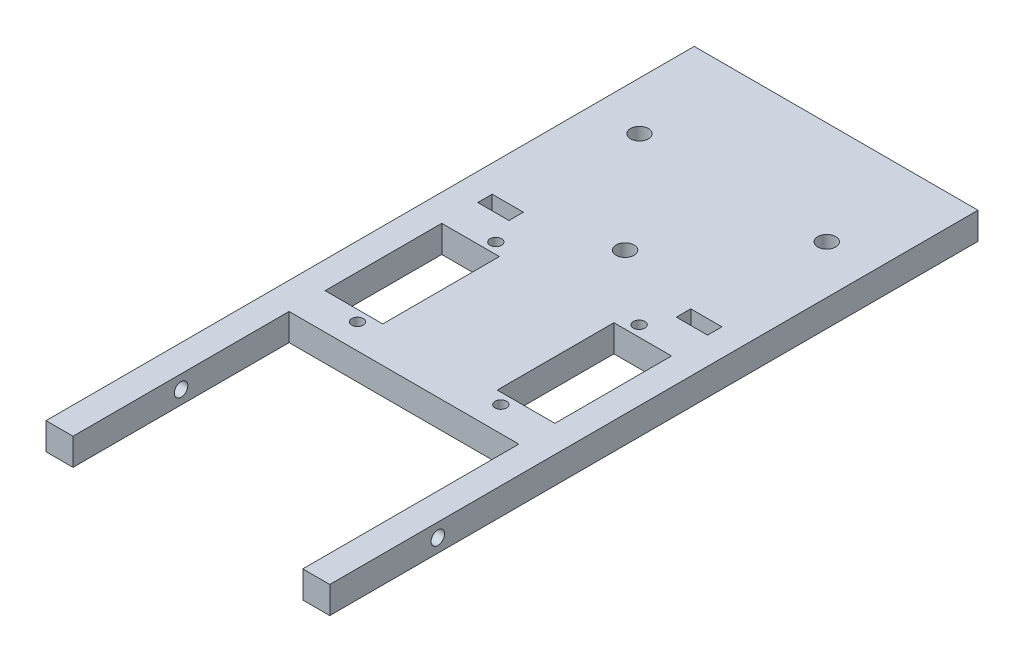
ISO-10303-21;
HEADER;
FILE_DESCRIPTION(('STEP AP214'),'2;1');
FILE_NAME('part.step','',(''),(''),'','','');
FILE_SCHEMA(('AUTOMOTIVE_DESIGN { 1 0 10303 214 1 1 1 1 }'));
ENDSEC;
DATA;
#1=APPLICATION_CONTEXT('core data for automotive mechanical design processes');
#2=APPLICATION_PROTOCOL_DEFINITION('international standard','automotive_design',2000,#1);
#3=PRODUCT_CONTEXT('',#1,'mechanical');
#4=PRODUCT('Part','Part','',(#3));
#5=PRODUCT_RELATED_PRODUCT_CATEGORY('part','',(#4));
#6=PRODUCT_DEFINITION_FORMATION('','',#4);
#7=PRODUCT_DEFINITION_CONTEXT('part definition',#1,'design');
#8=PRODUCT_DEFINITION('design','',#6,#7);
#9=PRODUCT_DEFINITION_SHAPE('','',#8);
#10=(LENGTH_UNIT() NAMED_UNIT(*) SI_UNIT(.MILLI.,.METRE.));
#11=(NAMED_UNIT(*) PLANE_ANGLE_UNIT() SI_UNIT($,.RADIAN.));
#12=(NAMED_UNIT(*) SI_UNIT($,.STERADIAN.) SOLID_ANGLE_UNIT());
#13=UNCERTAINTY_MEASURE_WITH_UNIT(LENGTH_MEASURE(1.E-05),#10,'distance_accuracy_value','');
#14=(GEOMETRIC_REPRESENTATION_CONTEXT(3) GLOBAL_UNCERTAINTY_ASSIGNED_CONTEXT((#13)) GLOBAL_UNIT_ASSIGNED_CONTEXT((#10,
#11,#12)) REPRESENTATION_CONTEXT('',''));
#15=CARTESIAN_POINT('',(0.,0.,0.));
#16=DIRECTION('',(0.,0.,1.));
#17=DIRECTION('',(1.,0.,0.));
#18=AXIS2_PLACEMENT_3D('',#15,#16,#17);
#19=CARTESIAN_POINT('',(-50.038,9.525,114.3));
#20=DIRECTION('',(0.,0.,-1.));
#21=DIRECTION('',(-1.,0.,0.));
#22=AXIS2_PLACEMENT_3D('',#19,#20,#21);
#23=PLANE('',#22);
#24=DIRECTION('',(1.,0.,0.));
#25=VECTOR('',#24,1.);
#26=CARTESIAN_POINT('',(-50.038,0.,114.3));
#27=LINE('',#26,#25);
#28=CARTESIAN_POINT('',(-50.038,0.,114.3));
#29=VERTEX_POINT('',#28);
#30=CARTESIAN_POINT('',(-40.513,0.,114.3));
#31=VERTEX_POINT('',#30);
#32=EDGE_CURVE('E362',#29,#31,#27,.T.);
#33=ORIENTED_EDGE('',*,*,#32,.T.);
#34=DIRECTION('',(0.,1.,0.));
#35=VECTOR('',#34,1.);
#36=CARTESIAN_POINT('',(-40.513,0.,114.3));
#37=LINE('',#36,#35);
#38=CARTESIAN_POINT('',(-40.513,9.525,114.3));
#39=VERTEX_POINT('',#38);
#40=EDGE_CURVE('E342',#31,#39,#37,.T.);
#41=ORIENTED_EDGE('',*,*,#40,.T.);
#42=DIRECTION('',(1.,0.,0.));
#43=VECTOR('',#42,1.);
#44=CARTESIAN_POINT('',(-50.038,9.525,114.3));
#45=LINE('',#44,#43);
#46=CARTESIAN_POINT('',(-50.038,9.525,114.3));
#47=VERTEX_POINT('',#46);
#48=EDGE_CURVE('E367',#47,#39,#45,.T.);
#49=ORIENTED_EDGE('',*,*,#48,.F.);
#50=DIRECTION('',(0.,-1.,0.));
#51=VECTOR('',#50,1.);
#52=CARTESIAN_POINT('',(-50.038,9.525,114.3));
#53=LINE('',#52,#51);
#54=EDGE_CURVE('E382',#47,#29,#53,.T.);
#55=ORIENTED_EDGE('',*,*,#54,.T.);
#56=EDGE_LOOP('',(#33,#41,#49,#55));
#57=FACE_BOUND('',#56,.T.);
#58=ADVANCED_FACE('F33',(#57),#23,.F.);
#59=CARTESIAN_POINT('',(50.038,9.525,-114.3));
#60=DIRECTION('',(-1.,0.,0.));
#61=DIRECTION('',(0.,0.,1.));
#62=AXIS2_PLACEMENT_3D('',#59,#60,#61);
#63=PLANE('',#62);
#64=CARTESIAN_POINT('',(50.038,4.7625,76.2));
#65=DIRECTION('',(1.,0.,0.));
#66=DIRECTION('',(0.,0.,-1.));
#67=AXIS2_PLACEMENT_3D('',#64,#65,#66);
#68=CIRCLE('',#67,2.38125000000001);
#69=CARTESIAN_POINT('',(50.038,4.7625,73.81875));
#70=VERTEX_POINT('',#69);
#71=EDGE_CURVE('E455',#70,#70,#68,.T.);
#72=ORIENTED_EDGE('',*,*,#71,.F.);
#73=EDGE_LOOP('',(#72));
#74=FACE_BOUND('',#73,.T.);
#75=DIRECTION('',(0.,0.,-1.));
#76=VECTOR('',#75,1.);
#77=CARTESIAN_POINT('',(50.038,0.,-114.3));
#78=LINE('',#77,#76);
#79=CARTESIAN_POINT('',(50.038,0.,114.3));
#80=VERTEX_POINT('',#79);
#81=CARTESIAN_POINT('',(50.038,0.,-114.3));
#82=VERTEX_POINT('',#81);
#83=EDGE_CURVE('E351',#80,#82,#78,.T.);
#84=ORIENTED_EDGE('',*,*,#83,.T.);
#85=DIRECTION('',(0.,-1.,0.));
#86=VECTOR('',#85,1.);
#87=CARTESIAN_POINT('',(50.038,9.525,-114.3));
#88=LINE('',#87,#86);
#89=CARTESIAN_POINT('',(50.038,9.525,-114.3));
#90=VERTEX_POINT('',#89);
#91=EDGE_CURVE('E11',#90,#82,#88,.T.);
#92=ORIENTED_EDGE('',*,*,#91,.F.);
#93=DIRECTION('',(0.,0.,-1.));
#94=VECTOR('',#93,1.);
#95=CARTESIAN_POINT('',(50.038,9.525,-114.3));
#96=LINE('',#95,#94);
#97=CARTESIAN_POINT('',(50.038,9.525,114.3));
#98=VERTEX_POINT('',#97);
#99=EDGE_CURVE('E358',#98,#90,#96,.T.);
#100=ORIENTED_EDGE('',*,*,#99,.F.);
#101=DIRECTION('',(0.,-1.,0.));
#102=VECTOR('',#101,1.);
#103=CARTESIAN_POINT('',(50.038,9.525,114.3));
#104=LINE('',#103,#102);
#105=EDGE_CURVE('E370',#98,#80,#104,.T.);
#106=ORIENTED_EDGE('',*,*,#105,.T.);
#107=EDGE_LOOP('',(#84,#92,#100,#106));
#108=FACE_BOUND('',#107,.T.);
#109=ADVANCED_FACE('F35',(#74,#108),#63,.F.);
#110=CARTESIAN_POINT('',(-50.038,9.525,-114.3));
#111=DIRECTION('',(0.,0.,1.));
#112=DIRECTION('',(1.,0.,0.));
#113=AXIS2_PLACEMENT_3D('',#110,#111,#112);
#114=PLANE('',#113);
#115=DIRECTION('',(-1.,0.,0.));
#116=VECTOR('',#115,1.);
#117=CARTESIAN_POINT('',(-50.038,0.,-114.3));
#118=LINE('',#117,#116);
#119=CARTESIAN_POINT('',(-50.038,0.,-114.3));
#120=VERTEX_POINT('',#119);
#121=EDGE_CURVE('E373',#82,#120,#118,.T.);
#122=ORIENTED_EDGE('',*,*,#121,.T.);
#123=DIRECTION('',(0.,-1.,0.));
#124=VECTOR('',#123,1.);
#125=CARTESIAN_POINT('',(-50.038,9.525,-114.3));
#126=LINE('',#125,#124);
#127=CARTESIAN_POINT('',(-50.038,9.525,-114.3));
#128=VERTEX_POINT('',#127);
#129=EDGE_CURVE('E42',#128,#120,#126,.T.);
#130=ORIENTED_EDGE('',*,*,#129,.F.);
#131=DIRECTION('',(-1.,0.,0.));
#132=VECTOR('',#131,1.);
#133=CARTESIAN_POINT('',(-50.038,9.525,-114.3));
#134=LINE('',#133,#132);
#135=EDGE_CURVE('E361',#90,#128,#134,.T.);
#136=ORIENTED_EDGE('',*,*,#135,.F.);
#137=ORIENTED_EDGE('',*,*,#91,.T.);
#138=EDGE_LOOP('',(#122,#130,#136,#137));
#139=FACE_BOUND('',#138,.T.);
#140=ADVANCED_FACE('F405',(#139),#114,.F.);
#141=CARTESIAN_POINT('',(-50.038,9.525,-114.3));
#142=DIRECTION('',(1.,0.,0.));
#143=DIRECTION('',(0.,0.,-1.));
#144=AXIS2_PLACEMENT_3D('',#141,#142,#143);
#145=PLANE('',#144);
#146=CARTESIAN_POINT('',(-50.038,4.7625,76.2));
#147=DIRECTION('',(1.,0.,0.));
#148=DIRECTION('',(0.,0.,-1.));
#149=AXIS2_PLACEMENT_3D('',#146,#147,#148);
#150=CIRCLE('',#149,2.38125000000001);
#151=CARTESIAN_POINT('',(-50.038,4.7625,73.81875));
#152=VERTEX_POINT('',#151);
#153=EDGE_CURVE('E453',#152,#152,#150,.T.);
#154=ORIENTED_EDGE('',*,*,#153,.T.);
#155=EDGE_LOOP('',(#154));
#156=FACE_BOUND('',#155,.T.);
#157=DIRECTION('',(0.,0.,1.));
#158=VECTOR('',#157,1.);
#159=CARTESIAN_POINT('',(-50.038,0.,-114.3));
#160=LINE('',#159,#158);
#161=EDGE_CURVE('E375',#120,#29,#160,.T.);
#162=ORIENTED_EDGE('',*,*,#161,.T.);
#163=ORIENTED_EDGE('',*,*,#54,.F.);
#164=DIRECTION('',(0.,0.,1.));
#165=VECTOR('',#164,1.);
#166=CARTESIAN_POINT('',(-50.038,9.525,-114.3));
#167=LINE('',#166,#165);
#168=EDGE_CURVE('E364',#128,#47,#167,.T.);
#169=ORIENTED_EDGE('',*,*,#168,.F.);
#170=ORIENTED_EDGE('',*,*,#129,.T.);
#171=EDGE_LOOP('',(#162,#163,#169,#170));
#172=FACE_BOUND('',#171,.T.);
#173=ADVANCED_FACE('F390',(#156,#172),#145,.F.);
#174=CARTESIAN_POINT('',(40.513,9.525,114.3));
#175=VERTEX_POINT('',#174);
#176=EDGE_CURVE('E366',#175,#98,#45,.T.);
#177=ORIENTED_EDGE('',*,*,#176,.F.);
#178=DIRECTION('',(0.,1.,0.));
#179=VECTOR('',#178,1.);
#180=CARTESIAN_POINT('',(40.513,0.,114.3));
#181=LINE('',#180,#179);
#182=CARTESIAN_POINT('',(40.513,0.,114.3));
#183=VERTEX_POINT('',#182);
#184=EDGE_CURVE('E354',#183,#175,#181,.T.);
#185=ORIENTED_EDGE('',*,*,#184,.F.);
#186=EDGE_CURVE('E377',#183,#80,#27,.T.);
#187=ORIENTED_EDGE('',*,*,#186,.T.);
#188=ORIENTED_EDGE('',*,*,#105,.F.);
#189=EDGE_LOOP('',(#177,#185,#187,#188));
#190=FACE_BOUND('',#189,.T.);
#191=ADVANCED_FACE('F412',(#190),#23,.F.);
#192=CARTESIAN_POINT('',(0.,9.525,0.));
#193=DIRECTION('',(0.,1.,0.));
#194=DIRECTION('',(0.,0.,1.));
#195=AXIS2_PLACEMENT_3D('',#192,#193,#194);
#196=PLANE('',#195);
#197=CARTESIAN_POINT('',(33.02,9.525,-77.978));
#198=DIRECTION('',(0.,1.,0.));
#199=DIRECTION('',(0.,0.,1.));
#200=AXIS2_PLACEMENT_3D('',#197,#198,#199);
#201=CIRCLE('',#200,3.175);
#202=CARTESIAN_POINT('',(33.02,9.525,-74.803));
#203=VERTEX_POINT('',#202);
#204=EDGE_CURVE('E464',#203,#203,#201,.T.);
#205=ORIENTED_EDGE('',*,*,#204,.F.);
#206=EDGE_LOOP('',(#205));
#207=FACE_BOUND('',#206,.T.);
#208=CARTESIAN_POINT('',(-33.02,9.525,-77.978));
#209=DIRECTION('',(0.,1.,0.));
#210=DIRECTION('',(0.,0.,1.));
#211=AXIS2_PLACEMENT_3D('',#208,#209,#210);
#212=CIRCLE('',#211,3.175);
#213=CARTESIAN_POINT('',(-33.02,9.525,-74.803));
#214=VERTEX_POINT('',#213);
#215=EDGE_CURVE('E469',#214,#214,#212,.T.);
#216=ORIENTED_EDGE('',*,*,#215,.F.);
#217=EDGE_LOOP('',(#216));
#218=FACE_BOUND('',#217,.T.);
#219=CARTESIAN_POINT('',(25.273,9.525,-19.558));
#220=DIRECTION('',(0.,1.,0.));
#221=DIRECTION('',(0.,0.,1.));
#222=AXIS2_PLACEMENT_3D('',#219,#220,#221);
#223=CIRCLE('',#222,2.032);
#224=CARTESIAN_POINT('',(25.273,9.525,-17.526));
#225=VERTEX_POINT('',#224);
#226=EDGE_CURVE('E472',#225,#225,#223,.T.);
#227=ORIENTED_EDGE('',*,*,#226,.F.);
#228=EDGE_LOOP('',(#227));
#229=FACE_BOUND('',#228,.T.);
#230=CARTESIAN_POINT('',(25.2730000000001,9.525,29.21));
#231=DIRECTION('',(0.,1.,0.));
#232=DIRECTION('',(0.,0.,1.));
#233=AXIS2_PLACEMENT_3D('',#230,#231,#232);
#234=CIRCLE('',#233,2.032);
#235=CARTESIAN_POINT('',(25.2730000000001,9.525,31.242));
#236=VERTEX_POINT('',#235);
#237=EDGE_CURVE('E475',#236,#236,#234,.T.);
#238=ORIENTED_EDGE('',*,*,#237,.F.);
#239=EDGE_LOOP('',(#238));
#240=FACE_BOUND('',#239,.T.);
#241=CARTESIAN_POINT('',(-25.273,9.525,29.21));
#242=DIRECTION('',(0.,1.,0.));
#243=DIRECTION('',(0.,0.,1.));
#244=AXIS2_PLACEMENT_3D('',#241,#242,#243);
#245=CIRCLE('',#244,2.032);
#246=CARTESIAN_POINT('',(-25.273,9.525,31.242));
#247=VERTEX_POINT('',#246);
#248=EDGE_CURVE('E478',#247,#247,#245,.T.);
#249=ORIENTED_EDGE('',*,*,#248,.F.);
#250=EDGE_LOOP('',(#249));
#251=FACE_BOUND('',#250,.T.);
#252=CARTESIAN_POINT('',(-25.273,9.525,-19.558));
#253=DIRECTION('',(0.,1.,0.));
#254=DIRECTION('',(0.,0.,1.));
#255=AXIS2_PLACEMENT_3D('',#252,#253,#254);
#256=CIRCLE('',#255,2.032);
#257=CARTESIAN_POINT('',(-25.273,9.525,-17.526));
#258=VERTEX_POINT('',#257);
#259=EDGE_CURVE('E481',#258,#258,#256,.T.);
#260=ORIENTED_EDGE('',*,*,#259,.F.);
#261=EDGE_LOOP('',(#260));
#262=FACE_BOUND('',#261,.T.);
#263=CARTESIAN_POINT('',(0.,9.525,-39.878));
#264=DIRECTION('',(0.,1.,0.));
#265=DIRECTION('',(0.,0.,1.));
#266=AXIS2_PLACEMENT_3D('',#263,#264,#265);
#267=CIRCLE('',#266,3.175);
#268=CARTESIAN_POINT('',(0.,9.525,-36.703));
#269=VERTEX_POINT('',#268);
#270=EDGE_CURVE('E461',#269,#269,#267,.T.);
#271=ORIENTED_EDGE('',*,*,#270,.F.);
#272=EDGE_LOOP('',(#271));
#273=FACE_BOUND('',#272,.T.);
#274=DIRECTION('',(0.,0.,1.));
#275=VECTOR('',#274,1.);
#276=CARTESIAN_POINT('',(-40.513,9.525,-33.528));
#277=LINE('',#276,#275);
#278=CARTESIAN_POINT('',(-40.513,9.525,-33.528));
#279=VERTEX_POINT('',#278);
#280=CARTESIAN_POINT('',(-40.513,9.525,-28.448));
#281=VERTEX_POINT('',#280);
#282=EDGE_CURVE('E49',#279,#281,#277,.T.);
#283=ORIENTED_EDGE('',*,*,#282,.F.);
#284=DIRECTION('',(-1.,0.,0.));
#285=VECTOR('',#284,1.);
#286=CARTESIAN_POINT('',(-40.513,9.525,-33.528));
#287=LINE('',#286,#285);
#288=CARTESIAN_POINT('',(-29.5148,9.525,-33.528));
#289=VERTEX_POINT('',#288);
#290=EDGE_CURVE('E216',#289,#279,#287,.T.);
#291=ORIENTED_EDGE('',*,*,#290,.F.);
#292=DIRECTION('',(0.,0.,-1.));
#293=VECTOR('',#292,1.);
#294=CARTESIAN_POINT('',(-29.5148,9.525,-33.528));
#295=LINE('',#294,#293);
#296=CARTESIAN_POINT('',(-29.5148,9.525,-28.448));
#297=VERTEX_POINT('',#296);
#298=EDGE_CURVE('E219',#297,#289,#295,.T.);
#299=ORIENTED_EDGE('',*,*,#298,.F.);
#300=DIRECTION('',(1.,0.,0.));
#301=VECTOR('',#300,1.);
#302=CARTESIAN_POINT('',(-40.513,9.525,-28.448));
#303=LINE('',#302,#301);
#304=EDGE_CURVE('E228',#281,#297,#303,.T.);
#305=ORIENTED_EDGE('',*,*,#304,.F.);
#306=EDGE_LOOP('',(#283,#291,#299,#305));
#307=FACE_BOUND('',#306,.T.);
#308=DIRECTION('',(-1.,0.,0.));
#309=VECTOR('',#308,1.);
#310=CARTESIAN_POINT('',(40.513,9.525,-15.748));
#311=LINE('',#310,#309);
#312=CARTESIAN_POINT('',(40.513,9.525,-15.748));
#313=VERTEX_POINT('',#312);
#314=CARTESIAN_POINT('',(20.193,9.525,-15.748));
#315=VERTEX_POINT('',#314);
#316=EDGE_CURVE('E57',#313,#315,#311,.T.);
#317=ORIENTED_EDGE('',*,*,#316,.F.);
#318=DIRECTION('',(0.,0.,-1.));
#319=VECTOR('',#318,1.);
#320=CARTESIAN_POINT('',(40.513,9.525,-15.748));
#321=LINE('',#320,#319);
#322=CARTESIAN_POINT('',(40.513,9.525,25.4));
#323=VERTEX_POINT('',#322);
#324=EDGE_CURVE('E243',#323,#313,#321,.T.);
#325=ORIENTED_EDGE('',*,*,#324,.F.);
#326=DIRECTION('',(1.,0.,0.));
#327=VECTOR('',#326,1.);
#328=CARTESIAN_POINT('',(40.513,9.525,25.4));
#329=LINE('',#328,#327);
#330=CARTESIAN_POINT('',(20.193,9.525,25.4));
#331=VERTEX_POINT('',#330);
#332=EDGE_CURVE('E258',#331,#323,#329,.T.);
#333=ORIENTED_EDGE('',*,*,#332,.F.);
#334=DIRECTION('',(0.,0.,1.));
#335=VECTOR('',#334,1.);
#336=CARTESIAN_POINT('',(20.193,9.525,-15.748));
#337=LINE('',#336,#335);
#338=EDGE_CURVE('E254',#315,#331,#337,.T.);
#339=ORIENTED_EDGE('',*,*,#338,.F.);
#340=EDGE_LOOP('',(#317,#325,#333,#339));
#341=FACE_BOUND('',#340,.T.);
#342=DIRECTION('',(-1.,0.,0.));
#343=VECTOR('',#342,1.);
#344=CARTESIAN_POINT('',(40.513,9.525,-33.528));
#345=LINE('',#344,#343);
#346=CARTESIAN_POINT('',(40.513,9.525,-33.528));
#347=VERTEX_POINT('',#346);
#348=CARTESIAN_POINT('',(29.5148,9.525,-33.528));
#349=VERTEX_POINT('',#348);
#350=EDGE_CURVE('E283',#347,#349,#345,.T.);
#351=ORIENTED_EDGE('',*,*,#350,.F.);
#352=DIRECTION('',(0.,0.,-1.));
#353=VECTOR('',#352,1.);
#354=CARTESIAN_POINT('',(40.513,9.525,-33.528));
#355=LINE('',#354,#353);
#356=CARTESIAN_POINT('',(40.513,9.525,-28.448));
#357=VERTEX_POINT('',#356);
#358=EDGE_CURVE('E273',#357,#347,#355,.T.);
#359=ORIENTED_EDGE('',*,*,#358,.F.);
#360=DIRECTION('',(1.,0.,0.));
#361=VECTOR('',#360,1.);
#362=CARTESIAN_POINT('',(40.513,9.525,-28.448));
#363=LINE('',#362,#361);
#364=CARTESIAN_POINT('',(29.5148,9.525,-28.448));
#365=VERTEX_POINT('',#364);
#366=EDGE_CURVE('E288',#365,#357,#363,.T.);
#367=ORIENTED_EDGE('',*,*,#366,.F.);
#368=DIRECTION('',(0.,0.,1.));
#369=VECTOR('',#368,1.);
#370=CARTESIAN_POINT('',(29.5148,9.525,-33.528));
#371=LINE('',#370,#369);
#372=EDGE_CURVE('E285',#349,#365,#371,.T.);
#373=ORIENTED_EDGE('',*,*,#372,.F.);
#374=EDGE_LOOP('',(#351,#359,#367,#373));
#375=FACE_BOUND('',#374,.T.);
#376=DIRECTION('',(0.,0.,1.));
#377=VECTOR('',#376,1.);
#378=CARTESIAN_POINT('',(-40.513,9.525,-15.748));
#379=LINE('',#378,#377);
#380=CARTESIAN_POINT('',(-40.513,9.525,-15.748));
#381=VERTEX_POINT('',#380);
#382=CARTESIAN_POINT('',(-40.513,9.525,25.4));
#383=VERTEX_POINT('',#382);
#384=EDGE_CURVE('E235',#381,#383,#379,.T.);
#385=ORIENTED_EDGE('',*,*,#384,.F.);
#386=DIRECTION('',(-1.,0.,0.));
#387=VECTOR('',#386,1.);
#388=CARTESIAN_POINT('',(-40.513,9.525,-15.748));
#389=LINE('',#388,#387);
#390=CARTESIAN_POINT('',(-20.193,9.525,-15.748));
#391=VERTEX_POINT('',#390);
#392=EDGE_CURVE('E304',#391,#381,#389,.T.);
#393=ORIENTED_EDGE('',*,*,#392,.F.);
#394=DIRECTION('',(0.,0.,-1.));
#395=VECTOR('',#394,1.);
#396=CARTESIAN_POINT('',(-20.193,9.525,-15.748));
#397=LINE('',#396,#395);
#398=CARTESIAN_POINT('',(-20.193,9.525,25.4));
#399=VERTEX_POINT('',#398);
#400=EDGE_CURVE('E318',#399,#391,#397,.T.);
#401=ORIENTED_EDGE('',*,*,#400,.F.);
#402=DIRECTION('',(1.,0.,0.));
#403=VECTOR('',#402,1.);
#404=CARTESIAN_POINT('',(-40.513,9.525,25.4));
#405=LINE('',#404,#403);
#406=EDGE_CURVE('E315',#383,#399,#405,.T.);
#407=ORIENTED_EDGE('',*,*,#406,.F.);
#408=EDGE_LOOP('',(#385,#393,#401,#407));
#409=FACE_BOUND('',#408,.T.);
#410=DIRECTION('',(0.,0.,1.));
#411=VECTOR('',#410,1.);
#412=CARTESIAN_POINT('',(-40.513,9.525,38.1));
#413=LINE('',#412,#411);
#414=CARTESIAN_POINT('',(-40.513,9.525,38.1));
#415=VERTEX_POINT('',#414);
#416=EDGE_CURVE('E325',#415,#39,#413,.T.);
#417=ORIENTED_EDGE('',*,*,#416,.F.);
#418=DIRECTION('',(-1.,0.,0.));
#419=VECTOR('',#418,1.);
#420=CARTESIAN_POINT('',(-40.513,9.525,38.1));
#421=LINE('',#420,#419);
#422=CARTESIAN_POINT('',(40.513,9.525,38.1));
#423=VERTEX_POINT('',#422);
#424=EDGE_CURVE('E336',#423,#415,#421,.T.);
#425=ORIENTED_EDGE('',*,*,#424,.F.);
#426=DIRECTION('',(0.,0.,-1.));
#427=VECTOR('',#426,1.);
#428=CARTESIAN_POINT('',(40.513,9.525,38.1));
#429=LINE('',#428,#427);
#430=EDGE_CURVE('E344',#175,#423,#429,.T.);
#431=ORIENTED_EDGE('',*,*,#430,.F.);
#432=ORIENTED_EDGE('',*,*,#176,.T.);
#433=ORIENTED_EDGE('',*,*,#99,.T.);
#434=ORIENTED_EDGE('',*,*,#135,.T.);
#435=ORIENTED_EDGE('',*,*,#168,.T.);
#436=ORIENTED_EDGE('',*,*,#48,.T.);
#437=EDGE_LOOP('',(#417,#425,#431,#432,#433,#434,#435,#436));
#438=FACE_BOUND('',#437,.T.);
#439=ADVANCED_FACE('F401',(#207,#218,#229,#240,#251,#262,#273,#307,#341,#375,#409,#438),#196,.T.);
#440=CARTESIAN_POINT('',(0.,0.,0.));
#441=DIRECTION('',(0.,1.,0.));
#442=DIRECTION('',(0.,0.,1.));
#443=AXIS2_PLACEMENT_3D('',#440,#441,#442);
#444=PLANE('',#443);
#445=CARTESIAN_POINT('',(33.02,0.,-77.978));
#446=DIRECTION('',(0.,1.,0.));
#447=DIRECTION('',(0.,0.,-1.));
#448=AXIS2_PLACEMENT_3D('',#445,#446,#447);
#449=CIRCLE('',#448,3.175);
#450=CARTESIAN_POINT('',(33.02,0.,-81.153));
#451=VERTEX_POINT('',#450);
#452=EDGE_CURVE('E488',#451,#451,#449,.T.);
#453=ORIENTED_EDGE('',*,*,#452,.T.);
#454=EDGE_LOOP('',(#453));
#455=FACE_BOUND('',#454,.T.);
#456=CARTESIAN_POINT('',(-33.02,0.,-77.978));
#457=DIRECTION('',(0.,1.,0.));
#458=DIRECTION('',(0.,0.,1.));
#459=AXIS2_PLACEMENT_3D('',#456,#457,#458);
#460=CIRCLE('',#459,3.175);
#461=CARTESIAN_POINT('',(-33.02,0.,-74.803));
#462=VERTEX_POINT('',#461);
#463=EDGE_CURVE('E491',#462,#462,#460,.T.);
#464=ORIENTED_EDGE('',*,*,#463,.T.);
#465=EDGE_LOOP('',(#464));
#466=FACE_BOUND('',#465,.T.);
#467=CARTESIAN_POINT('',(25.273,0.,-19.558));
#468=DIRECTION('',(0.,1.,0.));
#469=DIRECTION('',(0.,0.,-1.));
#470=AXIS2_PLACEMENT_3D('',#467,#468,#469);
#471=CIRCLE('',#470,2.032);
#472=CARTESIAN_POINT('',(25.273,0.,-21.59));
#473=VERTEX_POINT('',#472);
#474=EDGE_CURVE('E494',#473,#473,#471,.T.);
#475=ORIENTED_EDGE('',*,*,#474,.T.);
#476=EDGE_LOOP('',(#475));
#477=FACE_BOUND('',#476,.T.);
#478=CARTESIAN_POINT('',(25.2730000000001,0.,29.21));
#479=DIRECTION('',(0.,1.,0.));
#480=DIRECTION('',(0.,0.,-1.));
#481=AXIS2_PLACEMENT_3D('',#478,#479,#480);
#482=CIRCLE('',#481,2.032);
#483=CARTESIAN_POINT('',(25.2730000000001,0.,27.178));
#484=VERTEX_POINT('',#483);
#485=EDGE_CURVE('E497',#484,#484,#482,.T.);
#486=ORIENTED_EDGE('',*,*,#485,.T.);
#487=EDGE_LOOP('',(#486));
#488=FACE_BOUND('',#487,.T.);
#489=CARTESIAN_POINT('',(-25.273,0.,29.21));
#490=DIRECTION('',(0.,1.,0.));
#491=DIRECTION('',(0.,0.,1.));
#492=AXIS2_PLACEMENT_3D('',#489,#490,#491);
#493=CIRCLE('',#492,2.032);
#494=CARTESIAN_POINT('',(-25.273,0.,31.242));
#495=VERTEX_POINT('',#494);
#496=EDGE_CURVE('E487',#495,#495,#493,.T.);
#497=ORIENTED_EDGE('',*,*,#496,.T.);
#498=EDGE_LOOP('',(#497));
#499=FACE_BOUND('',#498,.T.);
#500=CARTESIAN_POINT('',(-25.273,0.,-19.558));
#501=DIRECTION('',(0.,1.,0.));
#502=DIRECTION('',(0.,0.,1.));
#503=AXIS2_PLACEMENT_3D('',#500,#501,#502);
#504=CIRCLE('',#503,2.032);
#505=CARTESIAN_POINT('',(-25.273,0.,-17.526));
#506=VERTEX_POINT('',#505);
#507=EDGE_CURVE('E484',#506,#506,#504,.T.);
#508=ORIENTED_EDGE('',*,*,#507,.T.);
#509=EDGE_LOOP('',(#508));
#510=FACE_BOUND('',#509,.T.);
#511=CARTESIAN_POINT('',(0.,0.,-39.878));
#512=DIRECTION('',(0.,1.,0.));
#513=DIRECTION('',(0.,0.,1.));
#514=AXIS2_PLACEMENT_3D('',#511,#512,#513);
#515=CIRCLE('',#514,3.175);
#516=CARTESIAN_POINT('',(0.,0.,-36.703));
#517=VERTEX_POINT('',#516);
#518=EDGE_CURVE('E458',#517,#517,#515,.T.);
#519=ORIENTED_EDGE('',*,*,#518,.T.);
#520=EDGE_LOOP('',(#519));
#521=FACE_BOUND('',#520,.T.);
#522=DIRECTION('',(-1.,0.,0.));
#523=VECTOR('',#522,1.);
#524=CARTESIAN_POINT('',(-40.513,0.,-33.528));
#525=LINE('',#524,#523);
#526=CARTESIAN_POINT('',(-29.5148,0.,-33.528));
#527=VERTEX_POINT('',#526);
#528=CARTESIAN_POINT('',(-40.513,0.,-33.528));
#529=VERTEX_POINT('',#528);
#530=EDGE_CURVE('E203',#527,#529,#525,.T.);
#531=ORIENTED_EDGE('',*,*,#530,.T.);
#532=DIRECTION('',(0.,0.,1.));
#533=VECTOR('',#532,1.);
#534=CARTESIAN_POINT('',(-40.513,0.,-33.528));
#535=LINE('',#534,#533);
#536=CARTESIAN_POINT('',(-40.513,0.,-28.448));
#537=VERTEX_POINT('',#536);
#538=EDGE_CURVE('E197',#529,#537,#535,.T.);
#539=ORIENTED_EDGE('',*,*,#538,.T.);
#540=DIRECTION('',(1.,0.,0.));
#541=VECTOR('',#540,1.);
#542=CARTESIAN_POINT('',(-40.513,0.,-28.448));
#543=LINE('',#542,#541);
#544=CARTESIAN_POINT('',(-29.5148,0.,-28.448));
#545=VERTEX_POINT('',#544);
#546=EDGE_CURVE('E207',#537,#545,#543,.T.);
#547=ORIENTED_EDGE('',*,*,#546,.T.);
#548=DIRECTION('',(0.,0.,-1.));
#549=VECTOR('',#548,1.);
#550=CARTESIAN_POINT('',(-29.5148,0.,-33.528));
#551=LINE('',#550,#549);
#552=EDGE_CURVE('E211',#545,#527,#551,.T.);
#553=ORIENTED_EDGE('',*,*,#552,.T.);
#554=EDGE_LOOP('',(#531,#539,#547,#553));
#555=FACE_BOUND('',#554,.T.);
#556=DIRECTION('',(0.,0.,-1.));
#557=VECTOR('',#556,1.);
#558=CARTESIAN_POINT('',(40.513,0.,-15.748));
#559=LINE('',#558,#557);
#560=CARTESIAN_POINT('',(40.513,0.,25.4));
#561=VERTEX_POINT('',#560);
#562=CARTESIAN_POINT('',(40.513,0.,-15.748));
#563=VERTEX_POINT('',#562);
#564=EDGE_CURVE('E249',#561,#563,#559,.T.);
#565=ORIENTED_EDGE('',*,*,#564,.T.);
#566=DIRECTION('',(-1.,0.,0.));
#567=VECTOR('',#566,1.);
#568=CARTESIAN_POINT('',(40.513,0.,-15.748));
#569=LINE('',#568,#567);
#570=CARTESIAN_POINT('',(20.193,0.,-15.748));
#571=VERTEX_POINT('',#570);
#572=EDGE_CURVE('E239',#563,#571,#569,.T.);
#573=ORIENTED_EDGE('',*,*,#572,.T.);
#574=DIRECTION('',(0.,0.,1.));
#575=VECTOR('',#574,1.);
#576=CARTESIAN_POINT('',(20.193,0.,-15.748));
#577=LINE('',#576,#575);
#578=CARTESIAN_POINT('',(20.193,0.,25.4));
#579=VERTEX_POINT('',#578);
#580=EDGE_CURVE('E242',#571,#579,#577,.T.);
#581=ORIENTED_EDGE('',*,*,#580,.T.);
#582=DIRECTION('',(1.,0.,0.));
#583=VECTOR('',#582,1.);
#584=CARTESIAN_POINT('',(40.513,0.,25.4));
#585=LINE('',#584,#583);
#586=EDGE_CURVE('E246',#579,#561,#585,.T.);
#587=ORIENTED_EDGE('',*,*,#586,.T.);
#588=EDGE_LOOP('',(#565,#573,#581,#587));
#589=FACE_BOUND('',#588,.T.);
#590=DIRECTION('',(0.,0.,-1.));
#591=VECTOR('',#590,1.);
#592=CARTESIAN_POINT('',(40.513,0.,-33.528));
#593=LINE('',#592,#591);
#594=CARTESIAN_POINT('',(40.513,0.,-28.448));
#595=VERTEX_POINT('',#594);
#596=CARTESIAN_POINT('',(40.513,0.,-33.528));
#597=VERTEX_POINT('',#596);
#598=EDGE_CURVE('E279',#595,#597,#593,.T.);
#599=ORIENTED_EDGE('',*,*,#598,.T.);
#600=DIRECTION('',(-1.,0.,0.));
#601=VECTOR('',#600,1.);
#602=CARTESIAN_POINT('',(40.513,0.,-33.528));
#603=LINE('',#602,#601);
#604=CARTESIAN_POINT('',(29.5148,0.,-33.528));
#605=VERTEX_POINT('',#604);
#606=EDGE_CURVE('E269',#597,#605,#603,.T.);
#607=ORIENTED_EDGE('',*,*,#606,.T.);
#608=DIRECTION('',(0.,0.,1.));
#609=VECTOR('',#608,1.);
#610=CARTESIAN_POINT('',(29.5148,0.,-33.528));
#611=LINE('',#610,#609);
#612=CARTESIAN_POINT('',(29.5148,0.,-28.448));
#613=VERTEX_POINT('',#612);
#614=EDGE_CURVE('E272',#605,#613,#611,.T.);
#615=ORIENTED_EDGE('',*,*,#614,.T.);
#616=DIRECTION('',(1.,0.,0.));
#617=VECTOR('',#616,1.);
#618=CARTESIAN_POINT('',(40.513,0.,-28.448));
#619=LINE('',#618,#617);
#620=EDGE_CURVE('E276',#613,#595,#619,.T.);
#621=ORIENTED_EDGE('',*,*,#620,.T.);
#622=EDGE_LOOP('',(#599,#607,#615,#621));
#623=FACE_BOUND('',#622,.T.);
#624=DIRECTION('',(-1.,0.,0.));
#625=VECTOR('',#624,1.);
#626=CARTESIAN_POINT('',(-40.513,0.,-15.748));
#627=LINE('',#626,#625);
#628=CARTESIAN_POINT('',(-20.193,0.,-15.748));
#629=VERTEX_POINT('',#628);
#630=CARTESIAN_POINT('',(-40.513,0.,-15.748));
#631=VERTEX_POINT('',#630);
#632=EDGE_CURVE('E310',#629,#631,#627,.T.);
#633=ORIENTED_EDGE('',*,*,#632,.T.);
#634=DIRECTION('',(0.,0.,1.));
#635=VECTOR('',#634,1.);
#636=CARTESIAN_POINT('',(-40.513,0.,-15.748));
#637=LINE('',#636,#635);
#638=CARTESIAN_POINT('',(-40.513,0.,25.4));
#639=VERTEX_POINT('',#638);
#640=EDGE_CURVE('E300',#631,#639,#637,.T.);
#641=ORIENTED_EDGE('',*,*,#640,.T.);
#642=DIRECTION('',(1.,0.,0.));
#643=VECTOR('',#642,1.);
#644=CARTESIAN_POINT('',(-40.513,0.,25.4));
#645=LINE('',#644,#643);
#646=CARTESIAN_POINT('',(-20.193,0.,25.4));
#647=VERTEX_POINT('',#646);
#648=EDGE_CURVE('E303',#639,#647,#645,.T.);
#649=ORIENTED_EDGE('',*,*,#648,.T.);
#650=DIRECTION('',(0.,0.,-1.));
#651=VECTOR('',#650,1.);
#652=CARTESIAN_POINT('',(-20.193,0.,-15.748));
#653=LINE('',#652,#651);
#654=EDGE_CURVE('E307',#647,#629,#653,.T.);
#655=ORIENTED_EDGE('',*,*,#654,.T.);
#656=EDGE_LOOP('',(#633,#641,#649,#655));
#657=FACE_BOUND('',#656,.T.);
#658=DIRECTION('',(-1.,0.,0.));
#659=VECTOR('',#658,1.);
#660=CARTESIAN_POINT('',(-40.513,0.,38.1));
#661=LINE('',#660,#659);
#662=CARTESIAN_POINT('',(40.513,0.,38.1));
#663=VERTEX_POINT('',#662);
#664=CARTESIAN_POINT('',(-40.513,0.,38.1));
#665=VERTEX_POINT('',#664);
#666=EDGE_CURVE('E339',#663,#665,#661,.T.);
#667=ORIENTED_EDGE('',*,*,#666,.T.);
#668=DIRECTION('',(0.,0.,1.));
#669=VECTOR('',#668,1.);
#670=CARTESIAN_POINT('',(-40.513,0.,38.1));
#671=LINE('',#670,#669);
#672=EDGE_CURVE('E332',#665,#31,#671,.T.);
#673=ORIENTED_EDGE('',*,*,#672,.T.);
#674=ORIENTED_EDGE('',*,*,#32,.F.);
#675=ORIENTED_EDGE('',*,*,#161,.F.);
#676=ORIENTED_EDGE('',*,*,#121,.F.);
#677=ORIENTED_EDGE('',*,*,#83,.F.);
#678=ORIENTED_EDGE('',*,*,#186,.F.);
#679=DIRECTION('',(0.,0.,-1.));
#680=VECTOR('',#679,1.);
#681=CARTESIAN_POINT('',(40.513,0.,38.1));
#682=LINE('',#681,#680);
#683=EDGE_CURVE('E335',#183,#663,#682,.T.);
#684=ORIENTED_EDGE('',*,*,#683,.T.);
#685=EDGE_LOOP('',(#667,#673,#674,#675,#676,#677,#678,#684));
#686=FACE_BOUND('',#685,.T.);
#687=ADVANCED_FACE('F213',(#455,#466,#477,#488,#499,#510,#521,#555,#589,#623,#657,#686),#444,.F.);
#688=CARTESIAN_POINT('',(-40.513,0.,38.1));
#689=DIRECTION('',(-1.,0.,0.));
#690=DIRECTION('',(0.,0.,1.));
#691=AXIS2_PLACEMENT_3D('',#688,#689,#690);
#692=PLANE('',#691);
#693=CARTESIAN_POINT('',(-40.513,4.7625,76.2));
#694=DIRECTION('',(-1.,0.,0.));
#695=DIRECTION('',(0.,0.,1.));
#696=AXIS2_PLACEMENT_3D('',#693,#694,#695);
#697=CIRCLE('',#696,2.38125000000001);
#698=CARTESIAN_POINT('',(-40.513,4.7625,78.58125));
#699=VERTEX_POINT('',#698);
#700=EDGE_CURVE('E222',#699,#699,#697,.T.);
#701=ORIENTED_EDGE('',*,*,#700,.T.);
#702=EDGE_LOOP('',(#701));
#703=FACE_BOUND('',#702,.T.);
#704=ORIENTED_EDGE('',*,*,#416,.T.);
#705=ORIENTED_EDGE('',*,*,#40,.F.);
#706=ORIENTED_EDGE('',*,*,#672,.F.);
#707=DIRECTION('',(0.,1.,0.));
#708=VECTOR('',#707,1.);
#709=CARTESIAN_POINT('',(-40.513,0.,38.1));
#710=LINE('',#709,#708);
#711=EDGE_CURVE('E349',#665,#415,#710,.T.);
#712=ORIENTED_EDGE('',*,*,#711,.T.);
#713=EDGE_LOOP('',(#704,#705,#706,#712));
#714=FACE_BOUND('',#713,.T.);
#715=ADVANCED_FACE('F420',(#703,#714),#692,.F.);
#716=CARTESIAN_POINT('',(-40.513,0.,38.1));
#717=DIRECTION('',(0.,0.,-1.));
#718=DIRECTION('',(-1.,0.,0.));
#719=AXIS2_PLACEMENT_3D('',#716,#717,#718);
#720=PLANE('',#719);
#721=ORIENTED_EDGE('',*,*,#424,.T.);
#722=ORIENTED_EDGE('',*,*,#711,.F.);
#723=ORIENTED_EDGE('',*,*,#666,.F.);
#724=DIRECTION('',(0.,1.,0.));
#725=VECTOR('',#724,1.);
#726=CARTESIAN_POINT('',(40.513,0.,38.1));
#727=LINE('',#726,#725);
#728=EDGE_CURVE('E352',#663,#423,#727,.T.);
#729=ORIENTED_EDGE('',*,*,#728,.T.);
#730=EDGE_LOOP('',(#721,#722,#723,#729));
#731=FACE_BOUND('',#730,.T.);
#732=ADVANCED_FACE('F418',(#731),#720,.F.);
#733=CARTESIAN_POINT('',(40.513,0.,38.1));
#734=DIRECTION('',(1.,0.,0.));
#735=DIRECTION('',(0.,0.,-1.));
#736=AXIS2_PLACEMENT_3D('',#733,#734,#735);
#737=PLANE('',#736);
#738=CARTESIAN_POINT('',(40.513,4.7625,76.2));
#739=DIRECTION('',(1.,0.,0.));
#740=DIRECTION('',(0.,0.,-1.));
#741=AXIS2_PLACEMENT_3D('',#738,#739,#740);
#742=CIRCLE('',#741,2.38125000000001);
#743=CARTESIAN_POINT('',(40.513,4.7625,73.81875));
#744=VERTEX_POINT('',#743);
#745=EDGE_CURVE('E37',#744,#744,#742,.T.);
#746=ORIENTED_EDGE('',*,*,#745,.T.);
#747=EDGE_LOOP('',(#746));
#748=FACE_BOUND('',#747,.T.);
#749=ORIENTED_EDGE('',*,*,#430,.T.);
#750=ORIENTED_EDGE('',*,*,#728,.F.);
#751=ORIENTED_EDGE('',*,*,#683,.F.);
#752=ORIENTED_EDGE('',*,*,#184,.T.);
#753=EDGE_LOOP('',(#749,#750,#751,#752));
#754=FACE_BOUND('',#753,.T.);
#755=ADVANCED_FACE('F415',(#748,#754),#737,.F.);
#756=CARTESIAN_POINT('',(-40.513,0.,-15.748));
#757=DIRECTION('',(-1.,0.,0.));
#758=DIRECTION('',(0.,0.,1.));
#759=AXIS2_PLACEMENT_3D('',#756,#757,#758);
#760=PLANE('',#759);
#761=ORIENTED_EDGE('',*,*,#384,.T.);
#762=DIRECTION('',(0.,1.,0.));
#763=VECTOR('',#762,1.);
#764=CARTESIAN_POINT('',(-40.513,0.,25.4));
#765=LINE('',#764,#763);
#766=EDGE_CURVE('E313',#639,#383,#765,.T.);
#767=ORIENTED_EDGE('',*,*,#766,.F.);
#768=ORIENTED_EDGE('',*,*,#640,.F.);
#769=DIRECTION('',(0.,1.,0.));
#770=VECTOR('',#769,1.);
#771=CARTESIAN_POINT('',(-40.513,0.,-15.748));
#772=LINE('',#771,#770);
#773=EDGE_CURVE('E323',#631,#381,#772,.T.);
#774=ORIENTED_EDGE('',*,*,#773,.T.);
#775=EDGE_LOOP('',(#761,#767,#768,#774));
#776=FACE_BOUND('',#775,.T.);
#777=ADVANCED_FACE('F588',(#776),#760,.F.);
#778=CARTESIAN_POINT('',(-40.513,0.,-15.748));
#779=DIRECTION('',(0.,0.,-1.));
#780=DIRECTION('',(-1.,0.,0.));
#781=AXIS2_PLACEMENT_3D('',#778,#779,#780);
#782=PLANE('',#781);
#783=ORIENTED_EDGE('',*,*,#392,.T.);
#784=ORIENTED_EDGE('',*,*,#773,.F.);
#785=ORIENTED_EDGE('',*,*,#632,.F.);
#786=DIRECTION('',(0.,1.,0.));
#787=VECTOR('',#786,1.);
#788=CARTESIAN_POINT('',(-20.193,0.,-15.748));
#789=LINE('',#788,#787);
#790=EDGE_CURVE('E326',#629,#391,#789,.T.);
#791=ORIENTED_EDGE('',*,*,#790,.T.);
#792=EDGE_LOOP('',(#783,#784,#785,#791));
#793=FACE_BOUND('',#792,.T.);
#794=ADVANCED_FACE('F584',(#793),#782,.F.);
#795=CARTESIAN_POINT('',(-20.193,0.,-15.748));
#796=DIRECTION('',(1.,0.,0.));
#797=DIRECTION('',(0.,0.,-1.));
#798=AXIS2_PLACEMENT_3D('',#795,#796,#797);
#799=PLANE('',#798);
#800=ORIENTED_EDGE('',*,*,#400,.T.);
#801=ORIENTED_EDGE('',*,*,#790,.F.);
#802=ORIENTED_EDGE('',*,*,#654,.F.);
#803=DIRECTION('',(0.,1.,0.));
#804=VECTOR('',#803,1.);
#805=CARTESIAN_POINT('',(-20.193,0.,25.4));
#806=LINE('',#805,#804);
#807=EDGE_CURVE('E328',#647,#399,#806,.T.);
#808=ORIENTED_EDGE('',*,*,#807,.T.);
#809=EDGE_LOOP('',(#800,#801,#802,#808));
#810=FACE_BOUND('',#809,.T.);
#811=ADVANCED_FACE('F587',(#810),#799,.F.);
#812=CARTESIAN_POINT('',(-40.513,0.,25.4));
#813=DIRECTION('',(0.,0.,1.));
#814=DIRECTION('',(1.,0.,0.));
#815=AXIS2_PLACEMENT_3D('',#812,#813,#814);
#816=PLANE('',#815);
#817=ORIENTED_EDGE('',*,*,#406,.T.);
#818=ORIENTED_EDGE('',*,*,#807,.F.);
#819=ORIENTED_EDGE('',*,*,#648,.F.);
#820=ORIENTED_EDGE('',*,*,#766,.T.);
#821=EDGE_LOOP('',(#817,#818,#819,#820));
#822=FACE_BOUND('',#821,.T.);
#823=ADVANCED_FACE('F582',(#822),#816,.F.);
#824=CARTESIAN_POINT('',(40.513,0.,-33.528));
#825=DIRECTION('',(0.,0.,-1.));
#826=DIRECTION('',(-1.,0.,0.));
#827=AXIS2_PLACEMENT_3D('',#824,#825,#826);
#828=PLANE('',#827);
#829=ORIENTED_EDGE('',*,*,#350,.T.);
#830=DIRECTION('',(0.,1.,0.));
#831=VECTOR('',#830,1.);
#832=CARTESIAN_POINT('',(29.5148,0.,-33.528));
#833=LINE('',#832,#831);
#834=EDGE_CURVE('E282',#605,#349,#833,.T.);
#835=ORIENTED_EDGE('',*,*,#834,.F.);
#836=ORIENTED_EDGE('',*,*,#606,.F.);
#837=DIRECTION('',(0.,1.,0.));
#838=VECTOR('',#837,1.);
#839=CARTESIAN_POINT('',(40.513,0.,-33.528));
#840=LINE('',#839,#838);
#841=EDGE_CURVE('E255',#597,#347,#840,.T.);
#842=ORIENTED_EDGE('',*,*,#841,.T.);
#843=EDGE_LOOP('',(#829,#835,#836,#842));
#844=FACE_BOUND('',#843,.T.);
#845=ADVANCED_FACE('F572',(#844),#828,.F.);
#846=CARTESIAN_POINT('',(40.513,0.,-33.528));
#847=DIRECTION('',(1.,0.,0.));
#848=DIRECTION('',(0.,0.,-1.));
#849=AXIS2_PLACEMENT_3D('',#846,#847,#848);
#850=PLANE('',#849);
#851=ORIENTED_EDGE('',*,*,#358,.T.);
#852=ORIENTED_EDGE('',*,*,#841,.F.);
#853=ORIENTED_EDGE('',*,*,#598,.F.);
#854=DIRECTION('',(0.,1.,0.));
#855=VECTOR('',#854,1.);
#856=CARTESIAN_POINT('',(40.513,0.,-28.448));
#857=LINE('',#856,#855);
#858=EDGE_CURVE('E294',#595,#357,#857,.T.);
#859=ORIENTED_EDGE('',*,*,#858,.T.);
#860=EDGE_LOOP('',(#851,#852,#853,#859));
#861=FACE_BOUND('',#860,.T.);
#862=ADVANCED_FACE('F568',(#861),#850,.F.);
#863=CARTESIAN_POINT('',(40.513,0.,-28.448));
#864=DIRECTION('',(0.,0.,1.));
#865=DIRECTION('',(1.,0.,0.));
#866=AXIS2_PLACEMENT_3D('',#863,#864,#865);
#867=PLANE('',#866);
#868=ORIENTED_EDGE('',*,*,#366,.T.);
#869=ORIENTED_EDGE('',*,*,#858,.F.);
#870=ORIENTED_EDGE('',*,*,#620,.F.);
#871=DIRECTION('',(0.,1.,0.));
#872=VECTOR('',#871,1.);
#873=CARTESIAN_POINT('',(29.5148,0.,-28.448));
#874=LINE('',#873,#872);
#875=EDGE_CURVE('E296',#613,#365,#874,.T.);
#876=ORIENTED_EDGE('',*,*,#875,.T.);
#877=EDGE_LOOP('',(#868,#869,#870,#876));
#878=FACE_BOUND('',#877,.T.);
#879=ADVANCED_FACE('F571',(#878),#867,.F.);
#880=CARTESIAN_POINT('',(29.5148,0.,-33.528));
#881=DIRECTION('',(-1.,0.,0.));
#882=DIRECTION('',(0.,0.,1.));
#883=AXIS2_PLACEMENT_3D('',#880,#881,#882);
#884=PLANE('',#883);
#885=ORIENTED_EDGE('',*,*,#372,.T.);
#886=ORIENTED_EDGE('',*,*,#875,.F.);
#887=ORIENTED_EDGE('',*,*,#614,.F.);
#888=ORIENTED_EDGE('',*,*,#834,.T.);
#889=EDGE_LOOP('',(#885,#886,#887,#888));
#890=FACE_BOUND('',#889,.T.);
#891=ADVANCED_FACE('F567',(#890),#884,.F.);
#892=CARTESIAN_POINT('',(40.513,0.,-15.748));
#893=DIRECTION('',(0.,0.,-1.));
#894=DIRECTION('',(-1.,0.,0.));
#895=AXIS2_PLACEMENT_3D('',#892,#893,#894);
#896=PLANE('',#895);
#897=ORIENTED_EDGE('',*,*,#316,.T.);
#898=DIRECTION('',(0.,1.,0.));
#899=VECTOR('',#898,1.);
#900=CARTESIAN_POINT('',(20.193,0.,-15.748));
#901=LINE('',#900,#899);
#902=EDGE_CURVE('E252',#571,#315,#901,.T.);
#903=ORIENTED_EDGE('',*,*,#902,.F.);
#904=ORIENTED_EDGE('',*,*,#572,.F.);
#905=DIRECTION('',(0.,1.,0.));
#906=VECTOR('',#905,1.);
#907=CARTESIAN_POINT('',(40.513,0.,-15.748));
#908=LINE('',#907,#906);
#909=EDGE_CURVE('E229',#563,#313,#908,.T.);
#910=ORIENTED_EDGE('',*,*,#909,.T.);
#911=EDGE_LOOP('',(#897,#903,#904,#910));
#912=FACE_BOUND('',#911,.T.);
#913=ADVANCED_FACE('F557',(#912),#896,.F.);
#914=CARTESIAN_POINT('',(40.513,0.,-15.748));
#915=DIRECTION('',(1.,0.,0.));
#916=DIRECTION('',(0.,0.,-1.));
#917=AXIS2_PLACEMENT_3D('',#914,#915,#916);
#918=PLANE('',#917);
#919=ORIENTED_EDGE('',*,*,#324,.T.);
#920=ORIENTED_EDGE('',*,*,#909,.F.);
#921=ORIENTED_EDGE('',*,*,#564,.F.);
#922=DIRECTION('',(0.,1.,0.));
#923=VECTOR('',#922,1.);
#924=CARTESIAN_POINT('',(40.513,0.,25.4));
#925=LINE('',#924,#923);
#926=EDGE_CURVE('E264',#561,#323,#925,.T.);
#927=ORIENTED_EDGE('',*,*,#926,.T.);
#928=EDGE_LOOP('',(#919,#920,#921,#927));
#929=FACE_BOUND('',#928,.T.);
#930=ADVANCED_FACE('F553',(#929),#918,.F.);
#931=CARTESIAN_POINT('',(40.513,0.,25.4));
#932=DIRECTION('',(0.,0.,1.));
#933=DIRECTION('',(1.,0.,0.));
#934=AXIS2_PLACEMENT_3D('',#931,#932,#933);
#935=PLANE('',#934);
#936=ORIENTED_EDGE('',*,*,#332,.T.);
#937=ORIENTED_EDGE('',*,*,#926,.F.);
#938=ORIENTED_EDGE('',*,*,#586,.F.);
#939=DIRECTION('',(0.,1.,0.));
#940=VECTOR('',#939,1.);
#941=CARTESIAN_POINT('',(20.193,0.,25.4));
#942=LINE('',#941,#940);
#943=EDGE_CURVE('E266',#579,#331,#942,.T.);
#944=ORIENTED_EDGE('',*,*,#943,.T.);
#945=EDGE_LOOP('',(#936,#937,#938,#944));
#946=FACE_BOUND('',#945,.T.);
#947=ADVANCED_FACE('F556',(#946),#935,.F.);
#948=CARTESIAN_POINT('',(20.193,0.,-15.748));
#949=DIRECTION('',(-1.,0.,0.));
#950=DIRECTION('',(0.,0.,1.));
#951=AXIS2_PLACEMENT_3D('',#948,#949,#950);
#952=PLANE('',#951);
#953=ORIENTED_EDGE('',*,*,#338,.T.);
#954=ORIENTED_EDGE('',*,*,#943,.F.);
#955=ORIENTED_EDGE('',*,*,#580,.F.);
#956=ORIENTED_EDGE('',*,*,#902,.T.);
#957=EDGE_LOOP('',(#953,#954,#955,#956));
#958=FACE_BOUND('',#957,.T.);
#959=ADVANCED_FACE('F552',(#958),#952,.F.);
#960=CARTESIAN_POINT('',(-40.513,0.,-33.528));
#961=DIRECTION('',(-1.,0.,0.));
#962=DIRECTION('',(0.,0.,1.));
#963=AXIS2_PLACEMENT_3D('',#960,#961,#962);
#964=PLANE('',#963);
#965=ORIENTED_EDGE('',*,*,#282,.T.);
#966=DIRECTION('',(0.,1.,0.));
#967=VECTOR('',#966,1.);
#968=CARTESIAN_POINT('',(-40.513,0.,-28.448));
#969=LINE('',#968,#967);
#970=EDGE_CURVE('E193',#537,#281,#969,.T.);
#971=ORIENTED_EDGE('',*,*,#970,.F.);
#972=ORIENTED_EDGE('',*,*,#538,.F.);
#973=DIRECTION('',(0.,1.,0.));
#974=VECTOR('',#973,1.);
#975=CARTESIAN_POINT('',(-40.513,0.,-33.528));
#976=LINE('',#975,#974);
#977=EDGE_CURVE('E233',#529,#279,#976,.T.);
#978=ORIENTED_EDGE('',*,*,#977,.T.);
#979=EDGE_LOOP('',(#965,#971,#972,#978));
#980=FACE_BOUND('',#979,.T.);
#981=ADVANCED_FACE('F195',(#980),#964,.F.);
#982=CARTESIAN_POINT('',(-40.513,0.,-33.528));
#983=DIRECTION('',(0.,0.,-1.));
#984=DIRECTION('',(-1.,0.,0.));
#985=AXIS2_PLACEMENT_3D('',#982,#983,#984);
#986=PLANE('',#985);
#987=ORIENTED_EDGE('',*,*,#290,.T.);
#988=ORIENTED_EDGE('',*,*,#977,.F.);
#989=ORIENTED_EDGE('',*,*,#530,.F.);
#990=DIRECTION('',(0.,1.,0.));
#991=VECTOR('',#990,1.);
#992=CARTESIAN_POINT('',(-29.5148,0.,-33.528));
#993=LINE('',#992,#991);
#994=EDGE_CURVE('E236',#527,#289,#993,.T.);
#995=ORIENTED_EDGE('',*,*,#994,.T.);
#996=EDGE_LOOP('',(#987,#988,#989,#995));
#997=FACE_BOUND('',#996,.T.);
#998=ADVANCED_FACE('F540',(#997),#986,.F.);
#999=CARTESIAN_POINT('',(-29.5148,0.,-33.528));
#1000=DIRECTION('',(1.,0.,0.));
#1001=DIRECTION('',(0.,0.,-1.));
#1002=AXIS2_PLACEMENT_3D('',#999,#1000,#1001);
#1003=PLANE('',#1002);
#1004=ORIENTED_EDGE('',*,*,#298,.T.);
#1005=ORIENTED_EDGE('',*,*,#994,.F.);
#1006=ORIENTED_EDGE('',*,*,#552,.F.);
#1007=DIRECTION('',(0.,1.,0.));
#1008=VECTOR('',#1007,1.);
#1009=CARTESIAN_POINT('',(-29.5148,0.,-28.448));
#1010=LINE('',#1009,#1008);
#1011=EDGE_CURVE('E202',#545,#297,#1010,.T.);
#1012=ORIENTED_EDGE('',*,*,#1011,.T.);
#1013=EDGE_LOOP('',(#1004,#1005,#1006,#1012));
#1014=FACE_BOUND('',#1013,.T.);
#1015=ADVANCED_FACE('F543',(#1014),#1003,.F.);
#1016=CARTESIAN_POINT('',(-40.513,0.,-28.448));
#1017=DIRECTION('',(0.,0.,1.));
#1018=DIRECTION('',(1.,0.,0.));
#1019=AXIS2_PLACEMENT_3D('',#1016,#1017,#1018);
#1020=PLANE('',#1019);
#1021=ORIENTED_EDGE('',*,*,#304,.T.);
#1022=ORIENTED_EDGE('',*,*,#1011,.F.);
#1023=ORIENTED_EDGE('',*,*,#546,.F.);
#1024=ORIENTED_EDGE('',*,*,#970,.T.);
#1025=EDGE_LOOP('',(#1021,#1022,#1023,#1024));
#1026=FACE_BOUND('',#1025,.T.);
#1027=ADVANCED_FACE('F208',(#1026),#1020,.F.);
#1028=CARTESIAN_POINT('',(-50.038,4.7625,76.2));
#1029=DIRECTION('',(1.,0.,0.));
#1030=DIRECTION('',(0.,0.,-1.));
#1031=AXIS2_PLACEMENT_3D('',#1028,#1029,#1030);
#1032=CYLINDRICAL_SURFACE('',#1031,2.38125000000001);
#1033=ORIENTED_EDGE('',*,*,#71,.T.);
#1034=EDGE_LOOP('',(#1033));
#1035=FACE_BOUND('',#1034,.T.);
#1036=ORIENTED_EDGE('',*,*,#745,.F.);
#1037=EDGE_LOOP('',(#1036));
#1038=FACE_BOUND('',#1037,.T.);
#1039=ADVANCED_FACE('F539',(#1035,#1038),#1032,.F.);
#1040=ORIENTED_EDGE('',*,*,#153,.F.);
#1041=EDGE_LOOP('',(#1040));
#1042=FACE_BOUND('',#1041,.T.);
#1043=ORIENTED_EDGE('',*,*,#700,.F.);
#1044=EDGE_LOOP('',(#1043));
#1045=FACE_BOUND('',#1044,.T.);
#1046=ADVANCED_FACE('F535',(#1042,#1045),#1032,.F.);
#1047=CARTESIAN_POINT('',(0.,0.,-39.878));
#1048=DIRECTION('',(0.,1.,0.));
#1049=DIRECTION('',(0.,0.,1.));
#1050=AXIS2_PLACEMENT_3D('',#1047,#1048,#1049);
#1051=CYLINDRICAL_SURFACE('',#1050,3.175);
#1052=ORIENTED_EDGE('',*,*,#518,.F.);
#1053=EDGE_LOOP('',(#1052));
#1054=FACE_BOUND('',#1053,.T.);
#1055=ORIENTED_EDGE('',*,*,#270,.T.);
#1056=EDGE_LOOP('',(#1055));
#1057=FACE_BOUND('',#1056,.T.);
#1058=ADVANCED_FACE('F518',(#1054,#1057),#1051,.F.);
#1059=CARTESIAN_POINT('',(-25.273,0.,-19.558));
#1060=DIRECTION('',(0.,1.,0.));
#1061=DIRECTION('',(0.,0.,1.));
#1062=AXIS2_PLACEMENT_3D('',#1059,#1060,#1061);
#1063=CYLINDRICAL_SURFACE('',#1062,2.032);
#1064=ORIENTED_EDGE('',*,*,#259,.T.);
#1065=EDGE_LOOP('',(#1064));
#1066=FACE_BOUND('',#1065,.T.);
#1067=ORIENTED_EDGE('',*,*,#507,.F.);
#1068=EDGE_LOOP('',(#1067));
#1069=FACE_BOUND('',#1068,.T.);
#1070=ADVANCED_FACE('F508',(#1066,#1069),#1063,.F.);
#1071=CARTESIAN_POINT('',(-25.273,0.,29.21));
#1072=DIRECTION('',(0.,1.,0.));
#1073=DIRECTION('',(0.,0.,1.));
#1074=AXIS2_PLACEMENT_3D('',#1071,#1072,#1073);
#1075=CYLINDRICAL_SURFACE('',#1074,2.032);
#1076=ORIENTED_EDGE('',*,*,#248,.T.);
#1077=EDGE_LOOP('',(#1076));
#1078=FACE_BOUND('',#1077,.T.);
#1079=ORIENTED_EDGE('',*,*,#496,.F.);
#1080=EDGE_LOOP('',(#1079));
#1081=FACE_BOUND('',#1080,.T.);
#1082=ADVANCED_FACE('F505',(#1078,#1081),#1075,.F.);
#1083=CARTESIAN_POINT('',(25.2730000000001,0.,29.21));
#1084=DIRECTION('',(0.,1.,0.));
#1085=DIRECTION('',(0.,0.,1.));
#1086=AXIS2_PLACEMENT_3D('',#1083,#1084,#1085);
#1087=CYLINDRICAL_SURFACE('',#1086,2.032);
#1088=ORIENTED_EDGE('',*,*,#237,.T.);
#1089=EDGE_LOOP('',(#1088));
#1090=FACE_BOUND('',#1089,.T.);
#1091=ORIENTED_EDGE('',*,*,#485,.F.);
#1092=EDGE_LOOP('',(#1091));
#1093=FACE_BOUND('',#1092,.T.);
#1094=ADVANCED_FACE('F507',(#1090,#1093),#1087,.F.);
#1095=CARTESIAN_POINT('',(25.273,0.,-19.558));
#1096=DIRECTION('',(0.,1.,0.));
#1097=DIRECTION('',(0.,0.,1.));
#1098=AXIS2_PLACEMENT_3D('',#1095,#1096,#1097);
#1099=CYLINDRICAL_SURFACE('',#1098,2.032);
#1100=ORIENTED_EDGE('',*,*,#226,.T.);
#1101=EDGE_LOOP('',(#1100));
#1102=FACE_BOUND('',#1101,.T.);
#1103=ORIENTED_EDGE('',*,*,#474,.F.);
#1104=EDGE_LOOP('',(#1103));
#1105=FACE_BOUND('',#1104,.T.);
#1106=ADVANCED_FACE('F515',(#1102,#1105),#1099,.F.);
#1107=CARTESIAN_POINT('',(-33.02,0.,-77.978));
#1108=DIRECTION('',(0.,1.,0.));
#1109=DIRECTION('',(0.,0.,1.));
#1110=AXIS2_PLACEMENT_3D('',#1107,#1108,#1109);
#1111=CYLINDRICAL_SURFACE('',#1110,3.175);
#1112=ORIENTED_EDGE('',*,*,#215,.T.);
#1113=EDGE_LOOP('',(#1112));
#1114=FACE_BOUND('',#1113,.T.);
#1115=ORIENTED_EDGE('',*,*,#463,.F.);
#1116=EDGE_LOOP('',(#1115));
#1117=FACE_BOUND('',#1116,.T.);
#1118=ADVANCED_FACE('F524',(#1114,#1117),#1111,.F.);
#1119=CARTESIAN_POINT('',(33.02,0.,-77.978));
#1120=DIRECTION('',(0.,1.,0.));
#1121=DIRECTION('',(0.,0.,1.));
#1122=AXIS2_PLACEMENT_3D('',#1119,#1120,#1121);
#1123=CYLINDRICAL_SURFACE('',#1122,3.175);
#1124=ORIENTED_EDGE('',*,*,#204,.T.);
#1125=EDGE_LOOP('',(#1124));
#1126=FACE_BOUND('',#1125,.T.);
#1127=ORIENTED_EDGE('',*,*,#452,.F.);
#1128=EDGE_LOOP('',(#1127));
#1129=FACE_BOUND('',#1128,.T.);
#1130=ADVANCED_FACE('F528',(#1126,#1129),#1123,.F.);
#1131=CLOSED_SHELL('',(#58,#109,#140,#173,#191,#439,#687,#715,#732,#755,#777,#794,#811,#823,
#845,#862,#879,#891,#913,#930,#947,#959,#981,#998,#1015,#1027,#1039,#1046,#1058,#1070,#1082,
#1094,#1106,#1118,#1130));
#1132=MANIFOLD_SOLID_BREP('B2',#1131);
#1133=ADVANCED_BREP_SHAPE_REPRESENTATION('',(#18,#1132),#14);
#1134=SHAPE_DEFINITION_REPRESENTATION(#9,#1133);
ENDSEC;
END-ISO-10303-21;
